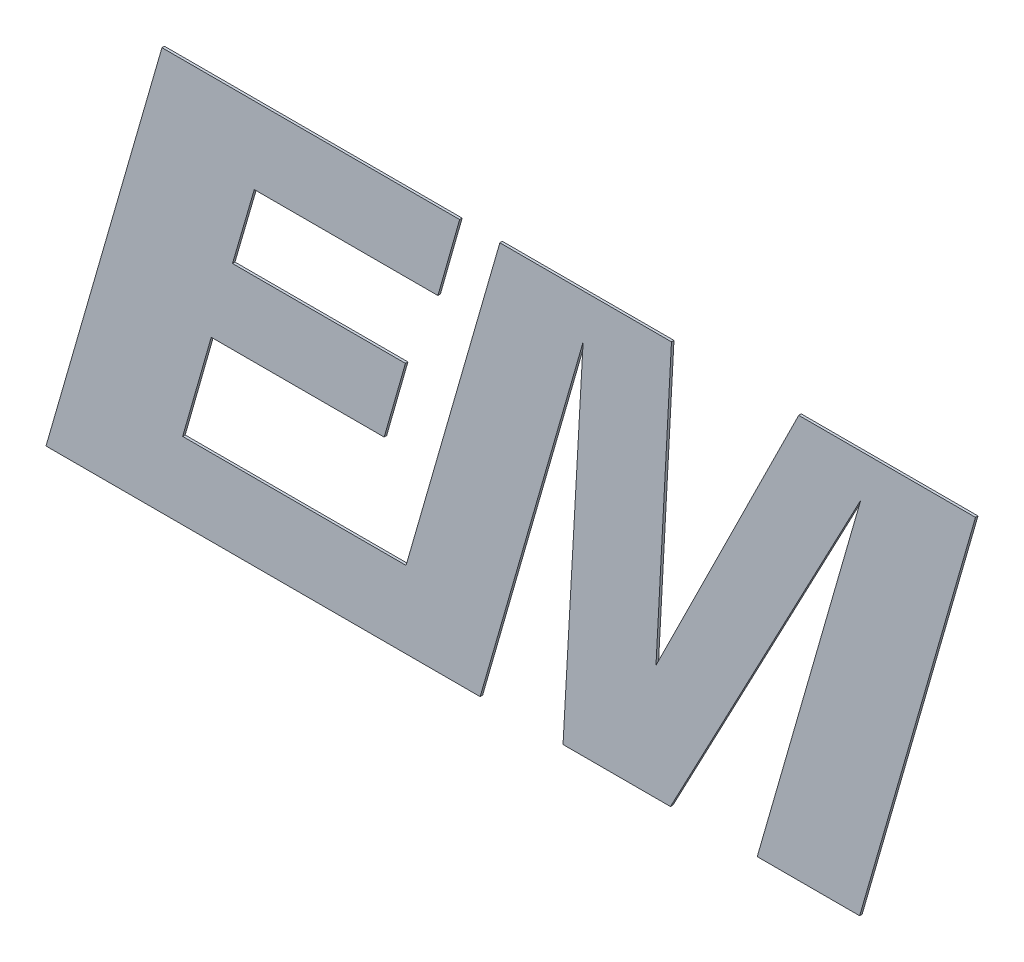
ISO-10303-21;
HEADER;
FILE_DESCRIPTION(('STEP AP214'),'2;1');
FILE_NAME('part.step','',(''),(''),'','','');
FILE_SCHEMA(('AUTOMOTIVE_DESIGN { 1 0 10303 214 1 1 1 1 }'));
ENDSEC;
DATA;
#1=APPLICATION_CONTEXT('core data for automotive mechanical design processes');
#2=APPLICATION_PROTOCOL_DEFINITION('international standard','automotive_design',2000,#1);
#3=PRODUCT_CONTEXT('',#1,'mechanical');
#4=PRODUCT('Part','Part','',(#3));
#5=PRODUCT_RELATED_PRODUCT_CATEGORY('part','',(#4));
#6=PRODUCT_DEFINITION_FORMATION('','',#4);
#7=PRODUCT_DEFINITION_CONTEXT('part definition',#1,'design');
#8=PRODUCT_DEFINITION('design','',#6,#7);
#9=PRODUCT_DEFINITION_SHAPE('','',#8);
#10=(LENGTH_UNIT() NAMED_UNIT(*) SI_UNIT(.MILLI.,.METRE.));
#11=(NAMED_UNIT(*) PLANE_ANGLE_UNIT() SI_UNIT($,.RADIAN.));
#12=(NAMED_UNIT(*) SI_UNIT($,.STERADIAN.) SOLID_ANGLE_UNIT());
#13=UNCERTAINTY_MEASURE_WITH_UNIT(LENGTH_MEASURE(1.E-05),#10,'distance_accuracy_value','');
#14=(GEOMETRIC_REPRESENTATION_CONTEXT(3) GLOBAL_UNCERTAINTY_ASSIGNED_CONTEXT((#13)) GLOBAL_UNIT_ASSIGNED_CONTEXT((#10,
#11,#12)) REPRESENTATION_CONTEXT('',''));
#15=CARTESIAN_POINT('',(0.,0.,0.));
#16=DIRECTION('',(0.,0.,1.));
#17=DIRECTION('',(1.,0.,0.));
#18=AXIS2_PLACEMENT_3D('',#15,#16,#17);
#19=CARTESIAN_POINT('',(4.26764666355344,3.60341048700408,2.505));
#20=DIRECTION('',(0.,-1.,0.));
#21=DIRECTION('',(0.,0.,-1.));
#22=AXIS2_PLACEMENT_3D('',#19,#20,#21);
#23=PLANE('',#22);
#24=DIRECTION('',(-1.,0.,0.));
#25=VECTOR('',#24,1.);
#26=CARTESIAN_POINT('',(4.26764666355344,3.60341048700408,2.5));
#27=LINE('',#26,#25);
#28=CARTESIAN_POINT('',(4.26764666355344,3.60341048700408,2.5));
#29=VERTEX_POINT('',#28);
#30=CARTESIAN_POINT('',(3.91393857891431,3.60341048700408,2.5));
#31=VERTEX_POINT('',#30);
#32=EDGE_CURVE('E11',#29,#31,#27,.T.);
#33=ORIENTED_EDGE('',*,*,#32,.T.);
#34=DIRECTION('',(0.,0.,-1.));
#35=VECTOR('',#34,1.);
#36=CARTESIAN_POINT('',(3.91393857891431,3.60341048700408,2.505));
#37=LINE('',#36,#35);
#38=CARTESIAN_POINT('',(3.91393857891431,3.60341048700408,2.505));
#39=VERTEX_POINT('',#38);
#40=EDGE_CURVE('E41',#39,#31,#37,.T.);
#41=ORIENTED_EDGE('',*,*,#40,.F.);
#42=DIRECTION('',(-1.,0.,0.));
#43=VECTOR('',#42,1.);
#44=CARTESIAN_POINT('',(4.26764666355344,3.60341048700408,2.505));
#45=LINE('',#44,#43);
#46=CARTESIAN_POINT('',(4.26764666355344,3.60341048700408,2.505));
#47=VERTEX_POINT('',#46);
#48=EDGE_CURVE('E54',#47,#39,#45,.T.);
#49=ORIENTED_EDGE('',*,*,#48,.F.);
#50=DIRECTION('',(0.,0.,-1.));
#51=VECTOR('',#50,1.);
#52=CARTESIAN_POINT('',(4.26764666355344,3.60341048700408,2.505));
#53=LINE('',#52,#51);
#54=EDGE_CURVE('E27',#47,#29,#53,.T.);
#55=ORIENTED_EDGE('',*,*,#54,.T.);
#56=EDGE_LOOP('',(#33,#41,#49,#55));
#57=FACE_BOUND('',#56,.T.);
#58=ADVANCED_FACE('F17',(#57),#23,.F.);
#59=CARTESIAN_POINT('',(3.91393857891431,3.60341048700408,2.505));
#60=DIRECTION('',(0.89586763618268,-0.444321030832952,0.));
#61=DIRECTION('',(0.,0.,-1.));
#62=AXIS2_PLACEMENT_3D('',#59,#60,#61);
#63=PLANE('',#62);
#64=DIRECTION('',(-0.444321030832952,-0.89586763618268,0.));
#65=VECTOR('',#64,1.);
#66=CARTESIAN_POINT('',(3.91393857891431,3.60341048700408,2.5));
#67=LINE('',#66,#65);
#68=CARTESIAN_POINT('',(3.62818914903049,3.02726475334241,2.5));
#69=VERTEX_POINT('',#68);
#70=EDGE_CURVE('E238',#31,#69,#67,.T.);
#71=ORIENTED_EDGE('',*,*,#70,.T.);
#72=DIRECTION('',(0.,0.,-1.));
#73=VECTOR('',#72,1.);
#74=CARTESIAN_POINT('',(3.62818914903049,3.02726475334241,2.505));
#75=LINE('',#74,#73);
#76=CARTESIAN_POINT('',(3.62818914903049,3.02726475334241,2.505));
#77=VERTEX_POINT('',#76);
#78=EDGE_CURVE('E331',#77,#69,#75,.T.);
#79=ORIENTED_EDGE('',*,*,#78,.F.);
#80=DIRECTION('',(-0.444321030832952,-0.89586763618268,0.));
#81=VECTOR('',#80,1.);
#82=CARTESIAN_POINT('',(3.91393857891431,3.60341048700408,2.505));
#83=LINE('',#82,#81);
#84=EDGE_CURVE('E288',#39,#77,#83,.T.);
#85=ORIENTED_EDGE('',*,*,#84,.F.);
#86=ORIENTED_EDGE('',*,*,#40,.T.);
#87=EDGE_LOOP('',(#71,#79,#85,#86));
#88=FACE_BOUND('',#87,.T.);
#89=ADVANCED_FACE('F544',(#88),#63,.F.);
#90=CARTESIAN_POINT('',(3.62818914903049,3.02726475334241,2.505));
#91=DIRECTION('',(-0.998554284376095,0.0537525920690858,0.));
#92=DIRECTION('',(0.,0.,1.));
#93=AXIS2_PLACEMENT_3D('',#90,#91,#92);
#94=PLANE('',#93);
#95=DIRECTION('',(0.0537525920690858,0.998554284376095,0.));
#96=VECTOR('',#95,1.);
#97=CARTESIAN_POINT('',(3.62818914903049,3.02726475334241,2.5));
#98=LINE('',#97,#96);
#99=CARTESIAN_POINT('',(3.65920331328618,3.60341048700408,2.5));
#100=VERTEX_POINT('',#99);
#101=EDGE_CURVE('E345',#69,#100,#98,.T.);
#102=ORIENTED_EDGE('',*,*,#101,.T.);
#103=DIRECTION('',(0.,0.,-1.));
#104=VECTOR('',#103,1.);
#105=CARTESIAN_POINT('',(3.65920331328618,3.60341048700408,2.505));
#106=LINE('',#105,#104);
#107=CARTESIAN_POINT('',(3.65920331328618,3.60341048700408,2.505));
#108=VERTEX_POINT('',#107);
#109=EDGE_CURVE('E273',#108,#100,#106,.T.);
#110=ORIENTED_EDGE('',*,*,#109,.F.);
#111=DIRECTION('',(0.0537525920690858,0.998554284376095,0.));
#112=VECTOR('',#111,1.);
#113=CARTESIAN_POINT('',(3.62818914903049,3.02726475334241,2.505));
#114=LINE('',#113,#112);
#115=EDGE_CURVE('E249',#77,#108,#114,.T.);
#116=ORIENTED_EDGE('',*,*,#115,.F.);
#117=ORIENTED_EDGE('',*,*,#78,.T.);
#118=EDGE_LOOP('',(#102,#110,#116,#117));
#119=FACE_BOUND('',#118,.T.);
#120=ADVANCED_FACE('F539',(#119),#94,.F.);
#121=CARTESIAN_POINT('',(3.65920331328618,3.60341048700408,2.505));
#122=DIRECTION('',(0.,-1.,0.));
#123=DIRECTION('',(0.,0.,-1.));
#124=AXIS2_PLACEMENT_3D('',#121,#122,#123);
#125=PLANE('',#124);
#126=DIRECTION('',(-1.,0.,0.));
#127=VECTOR('',#126,1.);
#128=CARTESIAN_POINT('',(3.65920331328618,3.60341048700408,2.5));
#129=LINE('',#128,#127);
#130=CARTESIAN_POINT('',(3.3157603234188,3.60341048700408,2.5));
#131=VERTEX_POINT('',#130);
#132=EDGE_CURVE('E276',#100,#131,#129,.T.);
#133=ORIENTED_EDGE('',*,*,#132,.T.);
#134=DIRECTION('',(0.,0.,-1.));
#135=VECTOR('',#134,1.);
#136=CARTESIAN_POINT('',(3.3157603234188,3.60341048700408,2.505));
#137=LINE('',#136,#135);
#138=CARTESIAN_POINT('',(3.3157603234188,3.60341048700408,2.505));
#139=VERTEX_POINT('',#138);
#140=EDGE_CURVE('E282',#139,#131,#137,.T.);
#141=ORIENTED_EDGE('',*,*,#140,.F.);
#142=DIRECTION('',(-1.,0.,0.));
#143=VECTOR('',#142,1.);
#144=CARTESIAN_POINT('',(3.65920331328618,3.60341048700408,2.505));
#145=LINE('',#144,#143);
#146=EDGE_CURVE('E241',#108,#139,#145,.T.);
#147=ORIENTED_EDGE('',*,*,#146,.F.);
#148=ORIENTED_EDGE('',*,*,#109,.T.);
#149=EDGE_LOOP('',(#133,#141,#147,#148));
#150=FACE_BOUND('',#149,.T.);
#151=ADVANCED_FACE('F543',(#150),#125,.F.);
#152=CARTESIAN_POINT('',(3.3157603234188,3.60341048700408,2.505));
#153=DIRECTION('',(0.961085306551383,-0.276251757516641,0.));
#154=DIRECTION('',(0.,0.,-1.));
#155=AXIS2_PLACEMENT_3D('',#152,#153,#154);
#156=PLANE('',#155);
#157=DIRECTION('',(-0.276251757516641,-0.961085306551383,0.));
#158=VECTOR('',#157,1.);
#159=CARTESIAN_POINT('',(3.3157603234188,3.60341048700408,2.5));
#160=LINE('',#159,#158);
#161=CARTESIAN_POINT('',(3.12805489301933,2.95037959685322,2.5));
#162=VERTEX_POINT('',#161);
#163=EDGE_CURVE('E277',#131,#162,#160,.T.);
#164=ORIENTED_EDGE('',*,*,#163,.T.);
#165=DIRECTION('',(0.,0.,-1.));
#166=VECTOR('',#165,1.);
#167=CARTESIAN_POINT('',(3.12805489301933,2.95037959685322,2.505));
#168=LINE('',#167,#166);
#169=CARTESIAN_POINT('',(3.12805489301933,2.95037959685322,2.505));
#170=VERTEX_POINT('',#169);
#171=EDGE_CURVE('E283',#170,#162,#168,.T.);
#172=ORIENTED_EDGE('',*,*,#171,.F.);
#173=DIRECTION('',(-0.276251757516641,-0.961085306551383,0.));
#174=VECTOR('',#173,1.);
#175=CARTESIAN_POINT('',(3.3157603234188,3.60341048700408,2.505));
#176=LINE('',#175,#174);
#177=EDGE_CURVE('E239',#139,#170,#176,.T.);
#178=ORIENTED_EDGE('',*,*,#177,.F.);
#179=ORIENTED_EDGE('',*,*,#140,.T.);
#180=EDGE_LOOP('',(#164,#172,#178,#179));
#181=FACE_BOUND('',#180,.T.);
#182=ADVANCED_FACE('F586',(#181),#156,.F.);
#183=CARTESIAN_POINT('',(3.12805489301933,2.95037959685322,2.505));
#184=DIRECTION('',(0.,-1.,0.));
#185=DIRECTION('',(0.,0.,-1.));
#186=AXIS2_PLACEMENT_3D('',#183,#184,#185);
#187=PLANE('',#186);
#188=DIRECTION('',(-1.,0.,0.));
#189=VECTOR('',#188,1.);
#190=CARTESIAN_POINT('',(3.12805489301933,2.95037959685322,2.5));
#191=LINE('',#190,#189);
#192=CARTESIAN_POINT('',(2.68099778065785,2.95037959685322,2.5));
#193=VERTEX_POINT('',#192);
#194=EDGE_CURVE('E278',#162,#193,#191,.T.);
#195=ORIENTED_EDGE('',*,*,#194,.T.);
#196=DIRECTION('',(0.,0.,-1.));
#197=VECTOR('',#196,1.);
#198=CARTESIAN_POINT('',(2.68099778065785,2.95037959685322,2.505));
#199=LINE('',#198,#197);
#200=CARTESIAN_POINT('',(2.68099778065785,2.95037959685322,2.505));
#201=VERTEX_POINT('',#200);
#202=EDGE_CURVE('E362',#201,#193,#199,.T.);
#203=ORIENTED_EDGE('',*,*,#202,.F.);
#204=DIRECTION('',(-1.,0.,0.));
#205=VECTOR('',#204,1.);
#206=CARTESIAN_POINT('',(3.12805489301933,2.95037959685322,2.505));
#207=LINE('',#206,#205);
#208=EDGE_CURVE('E242',#170,#201,#207,.T.);
#209=ORIENTED_EDGE('',*,*,#208,.F.);
#210=ORIENTED_EDGE('',*,*,#171,.T.);
#211=EDGE_LOOP('',(#195,#203,#209,#210));
#212=FACE_BOUND('',#211,.T.);
#213=ADVANCED_FACE('F570',(#212),#187,.F.);
#214=CARTESIAN_POINT('',(2.68099778065785,2.95037959685322,2.505));
#215=DIRECTION('',(-0.96172348726206,0.274021776595406,0.));
#216=DIRECTION('',(0.,0.,1.));
#217=AXIS2_PLACEMENT_3D('',#214,#215,#216);
#218=PLANE('',#217);
#219=DIRECTION('',(0.274021776595406,0.96172348726206,0.));
#220=VECTOR('',#219,1.);
#221=CARTESIAN_POINT('',(2.68099778065785,2.95037959685322,2.5));
#222=LINE('',#221,#220);
#223=CARTESIAN_POINT('',(2.73810782238338,3.15081647150003,2.5));
#224=VERTEX_POINT('',#223);
#225=EDGE_CURVE('E370',#193,#224,#222,.T.);
#226=ORIENTED_EDGE('',*,*,#225,.T.);
#227=DIRECTION('',(0.,0.,-1.));
#228=VECTOR('',#227,1.);
#229=CARTESIAN_POINT('',(2.73810782238338,3.15081647150003,2.505));
#230=LINE('',#229,#228);
#231=CARTESIAN_POINT('',(2.73810782238338,3.15081647150003,2.505));
#232=VERTEX_POINT('',#231);
#233=EDGE_CURVE('E266',#232,#224,#230,.T.);
#234=ORIENTED_EDGE('',*,*,#233,.F.);
#235=DIRECTION('',(0.274021776595406,0.96172348726206,0.));
#236=VECTOR('',#235,1.);
#237=CARTESIAN_POINT('',(2.68099778065785,2.95037959685322,2.505));
#238=LINE('',#237,#236);
#239=EDGE_CURVE('E252',#201,#232,#238,.T.);
#240=ORIENTED_EDGE('',*,*,#239,.F.);
#241=ORIENTED_EDGE('',*,*,#202,.T.);
#242=EDGE_LOOP('',(#226,#234,#240,#241));
#243=FACE_BOUND('',#242,.T.);
#244=ADVANCED_FACE('F565',(#243),#218,.F.);
#245=CARTESIAN_POINT('',(2.73810782238338,3.15081647150003,2.505));
#246=DIRECTION('',(0.,1.,0.));
#247=DIRECTION('',(1.,0.,0.));
#248=AXIS2_PLACEMENT_3D('',#245,#246,#247);
#249=PLANE('',#248);
#250=DIRECTION('',(1.,0.,0.));
#251=VECTOR('',#250,1.);
#252=CARTESIAN_POINT('',(2.73810782238338,3.15081647150003,2.5));
#253=LINE('',#252,#251);
#254=CARTESIAN_POINT('',(3.08420105076243,3.15081647150003,2.5));
#255=VERTEX_POINT('',#254);
#256=EDGE_CURVE('E358',#224,#255,#253,.T.);
#257=ORIENTED_EDGE('',*,*,#256,.T.);
#258=DIRECTION('',(0.,0.,-1.));
#259=VECTOR('',#258,1.);
#260=CARTESIAN_POINT('',(3.08420105076243,3.15081647150003,2.505));
#261=LINE('',#260,#259);
#262=CARTESIAN_POINT('',(3.08420105076243,3.15081647150003,2.505));
#263=VERTEX_POINT('',#262);
#264=EDGE_CURVE('E309',#263,#255,#261,.T.);
#265=ORIENTED_EDGE('',*,*,#264,.F.);
#266=DIRECTION('',(1.,0.,0.));
#267=VECTOR('',#266,1.);
#268=CARTESIAN_POINT('',(2.73810782238338,3.15081647150003,2.505));
#269=LINE('',#268,#267);
#270=EDGE_CURVE('E262',#232,#263,#269,.T.);
#271=ORIENTED_EDGE('',*,*,#270,.F.);
#272=ORIENTED_EDGE('',*,*,#233,.T.);
#273=EDGE_LOOP('',(#257,#265,#271,#272));
#274=FACE_BOUND('',#273,.T.);
#275=ADVANCED_FACE('F569',(#274),#249,.F.);
#276=CARTESIAN_POINT('',(3.08420105076243,3.15081647150003,2.505));
#277=DIRECTION('',(-0.961545429433448,0.27464593049169,0.));
#278=DIRECTION('',(0.,0.,1.));
#279=AXIS2_PLACEMENT_3D('',#276,#277,#278);
#280=PLANE('',#279);
#281=DIRECTION('',(0.27464593049169,0.961545429433448,0.));
#282=VECTOR('',#281,1.);
#283=CARTESIAN_POINT('',(3.08420105076243,3.15081647150003,2.5));
#284=LINE('',#283,#282);
#285=CARTESIAN_POINT('',(3.12678469114908,3.2999033511385,2.5));
#286=VERTEX_POINT('',#285);
#287=EDGE_CURVE('E414',#255,#286,#284,.T.);
#288=ORIENTED_EDGE('',*,*,#287,.T.);
#289=DIRECTION('',(0.,0.,-1.));
#290=VECTOR('',#289,1.);
#291=CARTESIAN_POINT('',(3.12678469114908,3.2999033511385,2.505));
#292=LINE('',#291,#290);
#293=CARTESIAN_POINT('',(3.12678469114908,3.2999033511385,2.505));
#294=VERTEX_POINT('',#293);
#295=EDGE_CURVE('E310',#294,#286,#292,.T.);
#296=ORIENTED_EDGE('',*,*,#295,.F.);
#297=DIRECTION('',(0.27464593049169,0.961545429433448,0.));
#298=VECTOR('',#297,1.);
#299=CARTESIAN_POINT('',(3.08420105076243,3.15081647150003,2.505));
#300=LINE('',#299,#298);
#301=EDGE_CURVE('E314',#263,#294,#300,.T.);
#302=ORIENTED_EDGE('',*,*,#301,.F.);
#303=ORIENTED_EDGE('',*,*,#264,.T.);
#304=EDGE_LOOP('',(#288,#296,#302,#303));
#305=FACE_BOUND('',#304,.T.);
#306=ADVANCED_FACE('F620',(#305),#280,.F.);
#307=CARTESIAN_POINT('',(3.12678469114908,3.2999033511385,2.505));
#308=DIRECTION('',(0.,-1.,0.));
#309=DIRECTION('',(0.,0.,-1.));
#310=AXIS2_PLACEMENT_3D('',#307,#308,#309);
#311=PLANE('',#310);
#312=DIRECTION('',(-1.,0.,0.));
#313=VECTOR('',#312,1.);
#314=CARTESIAN_POINT('',(3.12678469114908,3.2999033511385,2.5));
#315=LINE('',#314,#313);
#316=CARTESIAN_POINT('',(2.78064242022671,3.2999033511385,2.5));
#317=VERTEX_POINT('',#316);
#318=EDGE_CURVE('E305',#286,#317,#315,.T.);
#319=ORIENTED_EDGE('',*,*,#318,.T.);
#320=DIRECTION('',(0.,0.,-1.));
#321=VECTOR('',#320,1.);
#322=CARTESIAN_POINT('',(2.78064242022671,3.2999033511385,2.505));
#323=LINE('',#322,#321);
#324=CARTESIAN_POINT('',(2.78064242022671,3.2999033511385,2.505));
#325=VERTEX_POINT('',#324);
#326=EDGE_CURVE('E271',#325,#317,#323,.T.);
#327=ORIENTED_EDGE('',*,*,#326,.F.);
#328=DIRECTION('',(-1.,0.,0.));
#329=VECTOR('',#328,1.);
#330=CARTESIAN_POINT('',(3.12678469114908,3.2999033511385,2.505));
#331=LINE('',#330,#329);
#332=EDGE_CURVE('E311',#294,#325,#331,.T.);
#333=ORIENTED_EDGE('',*,*,#332,.F.);
#334=ORIENTED_EDGE('',*,*,#295,.T.);
#335=EDGE_LOOP('',(#319,#327,#333,#334));
#336=FACE_BOUND('',#335,.T.);
#337=ADVANCED_FACE('F596',(#336),#311,.F.);
#338=CARTESIAN_POINT('',(2.78064242022671,3.2999033511385,2.505));
#339=DIRECTION('',(-0.960176311432759,0.27939479408783,0.));
#340=DIRECTION('',(0.,0.,1.));
#341=AXIS2_PLACEMENT_3D('',#338,#339,#340);
#342=PLANE('',#341);
#343=DIRECTION('',(0.27939479408783,0.960176311432759,0.));
#344=VECTOR('',#343,1.);
#345=CARTESIAN_POINT('',(2.78064242022671,3.2999033511385,2.5));
#346=LINE('',#345,#344);
#347=CARTESIAN_POINT('',(2.8242902838039,3.44990487421018,2.5));
#348=VERTEX_POINT('',#347);
#349=EDGE_CURVE('E316',#317,#348,#346,.T.);
#350=ORIENTED_EDGE('',*,*,#349,.T.);
#351=DIRECTION('',(0.,0.,-1.));
#352=VECTOR('',#351,1.);
#353=CARTESIAN_POINT('',(2.8242902838039,3.44990487421018,2.505));
#354=LINE('',#353,#352);
#355=CARTESIAN_POINT('',(2.8242902838039,3.44990487421018,2.505));
#356=VERTEX_POINT('',#355);
#357=EDGE_CURVE('E272',#356,#348,#354,.T.);
#358=ORIENTED_EDGE('',*,*,#357,.F.);
#359=DIRECTION('',(0.27939479408783,0.960176311432759,0.));
#360=VECTOR('',#359,1.);
#361=CARTESIAN_POINT('',(2.78064242022671,3.2999033511385,2.505));
#362=LINE('',#361,#360);
#363=EDGE_CURVE('E315',#325,#356,#362,.T.);
#364=ORIENTED_EDGE('',*,*,#363,.F.);
#365=ORIENTED_EDGE('',*,*,#326,.T.);
#366=EDGE_LOOP('',(#350,#358,#364,#365));
#367=FACE_BOUND('',#366,.T.);
#368=ADVANCED_FACE('F592',(#367),#342,.F.);
#369=CARTESIAN_POINT('',(2.8242902838039,3.44990487421018,2.505));
#370=DIRECTION('',(0.,1.,0.));
#371=DIRECTION('',(1.,0.,0.));
#372=AXIS2_PLACEMENT_3D('',#369,#370,#371);
#373=PLANE('',#372);
#374=DIRECTION('',(1.,0.,0.));
#375=VECTOR('',#374,1.);
#376=CARTESIAN_POINT('',(2.8242902838039,3.44990487421018,2.5));
#377=LINE('',#376,#375);
#378=CARTESIAN_POINT('',(3.19172192279194,3.44990487421018,2.5));
#379=VERTEX_POINT('',#378);
#380=EDGE_CURVE('E268',#348,#379,#377,.T.);
#381=ORIENTED_EDGE('',*,*,#380,.T.);
#382=DIRECTION('',(0.,0.,-1.));
#383=VECTOR('',#382,1.);
#384=CARTESIAN_POINT('',(3.19172192279194,3.44990487421018,2.505));
#385=LINE('',#384,#383);
#386=CARTESIAN_POINT('',(3.19172192279194,3.44990487421018,2.505));
#387=VERTEX_POINT('',#386);
#388=EDGE_CURVE('E335',#387,#379,#385,.T.);
#389=ORIENTED_EDGE('',*,*,#388,.F.);
#390=DIRECTION('',(1.,0.,0.));
#391=VECTOR('',#390,1.);
#392=CARTESIAN_POINT('',(2.8242902838039,3.44990487421018,2.505));
#393=LINE('',#392,#391);
#394=EDGE_CURVE('E322',#356,#387,#393,.T.);
#395=ORIENTED_EDGE('',*,*,#394,.F.);
#396=ORIENTED_EDGE('',*,*,#357,.T.);
#397=EDGE_LOOP('',(#381,#389,#395,#396));
#398=FACE_BOUND('',#397,.T.);
#399=ADVANCED_FACE('F501',(#398),#373,.F.);
#400=CARTESIAN_POINT('',(3.19172192279194,3.44990487421018,2.505));
#401=DIRECTION('',(-0.961953028041548,0.273214882174628,0.));
#402=DIRECTION('',(0.,0.,1.));
#403=AXIS2_PLACEMENT_3D('',#400,#401,#402);
#404=PLANE('',#403);
#405=DIRECTION('',(0.273214882174628,0.961953028041548,0.));
#406=VECTOR('',#405,1.);
#407=CARTESIAN_POINT('',(3.19172192279194,3.44990487421018,2.5));
#408=LINE('',#407,#406);
#409=CARTESIAN_POINT('',(3.23532074382587,3.60341048700408,2.5));
#410=VERTEX_POINT('',#409);
#411=EDGE_CURVE('E296',#379,#410,#408,.T.);
#412=ORIENTED_EDGE('',*,*,#411,.T.);
#413=DIRECTION('',(0.,0.,-1.));
#414=VECTOR('',#413,1.);
#415=CARTESIAN_POINT('',(3.23532074382587,3.60341048700408,2.505));
#416=LINE('',#415,#414);
#417=CARTESIAN_POINT('',(3.23532074382587,3.60341048700408,2.505));
#418=VERTEX_POINT('',#417);
#419=EDGE_CURVE('E349',#418,#410,#416,.T.);
#420=ORIENTED_EDGE('',*,*,#419,.F.);
#421=DIRECTION('',(0.273214882174628,0.961953028041548,0.));
#422=VECTOR('',#421,1.);
#423=CARTESIAN_POINT('',(3.19172192279194,3.44990487421018,2.505));
#424=LINE('',#423,#422);
#425=EDGE_CURVE('E369',#387,#418,#424,.T.);
#426=ORIENTED_EDGE('',*,*,#425,.F.);
#427=ORIENTED_EDGE('',*,*,#388,.T.);
#428=EDGE_LOOP('',(#412,#420,#426,#427));
#429=FACE_BOUND('',#428,.T.);
#430=ADVANCED_FACE('F503',(#429),#404,.F.);
#431=CARTESIAN_POINT('',(3.23532074382587,3.60341048700408,2.505));
#432=DIRECTION('',(0.,-1.,0.));
#433=DIRECTION('',(0.,0.,-1.));
#434=AXIS2_PLACEMENT_3D('',#431,#432,#433);
#435=PLANE('',#434);
#436=DIRECTION('',(-1.,0.,0.));
#437=VECTOR('',#436,1.);
#438=CARTESIAN_POINT('',(3.23532074382587,3.60341048700408,2.5));
#439=LINE('',#438,#437);
#440=CARTESIAN_POINT('',(2.63953476239201,3.60341048700408,2.5));
#441=VERTEX_POINT('',#440);
#442=EDGE_CURVE('E375',#410,#441,#439,.T.);
#443=ORIENTED_EDGE('',*,*,#442,.T.);
#444=DIRECTION('',(0.,0.,-1.));
#445=VECTOR('',#444,1.);
#446=CARTESIAN_POINT('',(2.63953476239201,3.60341048700408,2.505));
#447=LINE('',#446,#445);
#448=CARTESIAN_POINT('',(2.63953476239201,3.60341048700408,2.505));
#449=VERTEX_POINT('',#448);
#450=EDGE_CURVE('E336',#449,#441,#447,.T.);
#451=ORIENTED_EDGE('',*,*,#450,.F.);
#452=DIRECTION('',(-1.,0.,0.));
#453=VECTOR('',#452,1.);
#454=CARTESIAN_POINT('',(3.23532074382587,3.60341048700408,2.505));
#455=LINE('',#454,#453);
#456=EDGE_CURVE('E365',#418,#449,#455,.T.);
#457=ORIENTED_EDGE('',*,*,#456,.F.);
#458=ORIENTED_EDGE('',*,*,#419,.T.);
#459=EDGE_LOOP('',(#443,#451,#457,#458));
#460=FACE_BOUND('',#459,.T.);
#461=ADVANCED_FACE('F506',(#460),#435,.F.);
#462=CARTESIAN_POINT('',(2.63953476239201,3.60341048700408,2.505));
#463=DIRECTION('',(0.961002990822128,-0.276537975024996,0.));
#464=DIRECTION('',(0.,0.,-1.));
#465=AXIS2_PLACEMENT_3D('',#462,#463,#464);
#466=PLANE('',#465);
#467=DIRECTION('',(-0.276537975024996,-0.961002990822128,0.));
#468=VECTOR('',#467,1.);
#469=CARTESIAN_POINT('',(2.63953476239201,3.60341048700408,2.5));
#470=LINE('',#469,#468);
#471=CARTESIAN_POINT('',(2.40746789876758,2.79695,2.5));
#472=VERTEX_POINT('',#471);
#473=EDGE_CURVE('E339',#441,#472,#470,.T.);
#474=ORIENTED_EDGE('',*,*,#473,.T.);
#475=DIRECTION('',(0.,0.,-1.));
#476=VECTOR('',#475,1.);
#477=CARTESIAN_POINT('',(2.40746789876758,2.79695,2.505));
#478=LINE('',#477,#476);
#479=CARTESIAN_POINT('',(2.40746789876758,2.79695,2.505));
#480=VERTEX_POINT('',#479);
#481=EDGE_CURVE('E354',#480,#472,#478,.T.);
#482=ORIENTED_EDGE('',*,*,#481,.F.);
#483=DIRECTION('',(-0.276537975024996,-0.961002990822128,0.));
#484=VECTOR('',#483,1.);
#485=CARTESIAN_POINT('',(2.63953476239201,3.60341048700408,2.505));
#486=LINE('',#485,#484);
#487=EDGE_CURVE('E300',#449,#480,#486,.T.);
#488=ORIENTED_EDGE('',*,*,#487,.F.);
#489=ORIENTED_EDGE('',*,*,#450,.T.);
#490=EDGE_LOOP('',(#474,#482,#488,#489));
#491=FACE_BOUND('',#490,.T.);
#492=ADVANCED_FACE('F471',(#491),#466,.F.);
#493=CARTESIAN_POINT('',(3.13272619462976,2.79695,2.505));
#494=DIRECTION('',(0.,1.,0.));
#495=DIRECTION('',(1.,0.,0.));
#496=AXIS2_PLACEMENT_3D('',#493,#494,#495);
#497=PLANE('',#496);
#498=DIRECTION('',(1.,0.,0.));
#499=VECTOR('',#498,1.);
#500=CARTESIAN_POINT('',(3.13272619462976,2.79695,2.5));
#501=LINE('',#500,#499);
#502=CARTESIAN_POINT('',(3.27627371899784,2.79695,2.5));
#503=VERTEX_POINT('',#502);
#504=EDGE_CURVE('E21',#472,#503,#501,.T.);
#505=ORIENTED_EDGE('',*,*,#504,.T.);
#506=DIRECTION('',(0.,0.,-1.));
#507=VECTOR('',#506,1.);
#508=CARTESIAN_POINT('',(3.27627371899784,2.79695,2.505));
#509=LINE('',#508,#507);
#510=CARTESIAN_POINT('',(3.27627371899784,2.79695,2.505));
#511=VERTEX_POINT('',#510);
#512=EDGE_CURVE('E355',#511,#503,#509,.T.);
#513=ORIENTED_EDGE('',*,*,#512,.F.);
#514=DIRECTION('',(1.,0.,0.));
#515=VECTOR('',#514,1.);
#516=CARTESIAN_POINT('',(2.40746789876758,2.79695,2.505));
#517=LINE('',#516,#515);
#518=EDGE_CURVE('E297',#480,#511,#517,.T.);
#519=ORIENTED_EDGE('',*,*,#518,.F.);
#520=ORIENTED_EDGE('',*,*,#481,.T.);
#521=EDGE_LOOP('',(#505,#513,#519,#520));
#522=FACE_BOUND('',#521,.T.);
#523=ADVANCED_FACE('F454',(#522),#497,.F.);
#524=CARTESIAN_POINT('',(3.27627371899784,2.79695,2.505));
#525=DIRECTION('',(-0.961163884540897,0.27597823655907,0.));
#526=DIRECTION('',(0.,0.,1.));
#527=AXIS2_PLACEMENT_3D('',#524,#525,#526);
#528=PLANE('',#527);
#529=DIRECTION('',(0.27597823655907,0.961163884540897,0.));
#530=VECTOR('',#529,1.);
#531=CARTESIAN_POINT('',(3.27627371899784,2.79695,2.5));
#532=LINE('',#531,#530);
#533=CARTESIAN_POINT('',(3.48242404994483,3.51492057392236,2.5));
#534=VERTEX_POINT('',#533);
#535=EDGE_CURVE('E350',#503,#534,#532,.T.);
#536=ORIENTED_EDGE('',*,*,#535,.T.);
#537=DIRECTION('',(0.,0.,-1.));
#538=VECTOR('',#537,1.);
#539=CARTESIAN_POINT('',(3.48242404994483,3.51492057392236,2.505));
#540=LINE('',#539,#538);
#541=CARTESIAN_POINT('',(3.48242404994483,3.51492057392236,2.505));
#542=VERTEX_POINT('',#541);
#543=EDGE_CURVE('E431',#542,#534,#540,.T.);
#544=ORIENTED_EDGE('',*,*,#543,.F.);
#545=DIRECTION('',(0.27597823655907,0.961163884540897,0.));
#546=VECTOR('',#545,1.);
#547=CARTESIAN_POINT('',(3.27627371899784,2.79695,2.505));
#548=LINE('',#547,#546);
#549=EDGE_CURVE('E301',#511,#542,#548,.T.);
#550=ORIENTED_EDGE('',*,*,#549,.F.);
#551=ORIENTED_EDGE('',*,*,#512,.T.);
#552=EDGE_LOOP('',(#536,#544,#550,#551));
#553=FACE_BOUND('',#552,.T.);
#554=ADVANCED_FACE('F464',(#553),#528,.F.);
#555=CARTESIAN_POINT('',(3.48242404994483,3.51492057392236,2.505));
#556=DIRECTION('',(0.998432730113024,-0.0559650197806937,0.));
#557=DIRECTION('',(0.,0.,-1.));
#558=AXIS2_PLACEMENT_3D('',#555,#556,#557);
#559=PLANE('',#558);
#560=DIRECTION('',(-0.0559650197806937,-0.998432730113024,0.));
#561=VECTOR('',#560,1.);
#562=CARTESIAN_POINT('',(3.48242404994483,3.51492057392236,2.5));
#563=LINE('',#562,#561);
#564=CARTESIAN_POINT('',(3.44217973887645,2.79695,2.5));
#565=VERTEX_POINT('',#564);
#566=EDGE_CURVE('E408',#534,#565,#563,.T.);
#567=ORIENTED_EDGE('',*,*,#566,.T.);
#568=DIRECTION('',(0.,0.,-1.));
#569=VECTOR('',#568,1.);
#570=CARTESIAN_POINT('',(3.44217973887645,2.79695,2.505));
#571=LINE('',#570,#569);
#572=CARTESIAN_POINT('',(3.44217973887645,2.79695,2.505));
#573=VERTEX_POINT('',#572);
#574=EDGE_CURVE('E323',#573,#565,#571,.T.);
#575=ORIENTED_EDGE('',*,*,#574,.F.);
#576=DIRECTION('',(-0.0559650197806937,-0.998432730113024,0.));
#577=VECTOR('',#576,1.);
#578=CARTESIAN_POINT('',(3.48242404994483,3.51492057392236,2.505));
#579=LINE('',#578,#577);
#580=EDGE_CURVE('E342',#542,#573,#579,.T.);
#581=ORIENTED_EDGE('',*,*,#580,.F.);
#582=ORIENTED_EDGE('',*,*,#543,.T.);
#583=EDGE_LOOP('',(#567,#575,#581,#582));
#584=FACE_BOUND('',#583,.T.);
#585=ADVANCED_FACE('F521',(#584),#559,.F.);
#586=CARTESIAN_POINT('',(3.44217973887645,2.79695,2.505));
#587=DIRECTION('',(0.,1.,0.));
#588=DIRECTION('',(1.,0.,0.));
#589=AXIS2_PLACEMENT_3D('',#586,#587,#588);
#590=PLANE('',#589);
#591=DIRECTION('',(1.,0.,0.));
#592=VECTOR('',#591,1.);
#593=CARTESIAN_POINT('',(3.44217973887645,2.79695,2.5));
#594=LINE('',#593,#592);
#595=CARTESIAN_POINT('',(3.65717489251533,2.79695,2.5));
#596=VERTEX_POINT('',#595);
#597=EDGE_CURVE('E236',#565,#596,#594,.T.);
#598=ORIENTED_EDGE('',*,*,#597,.T.);
#599=DIRECTION('',(0.,0.,-1.));
#600=VECTOR('',#599,1.);
#601=CARTESIAN_POINT('',(3.65717489251533,2.79695,2.505));
#602=LINE('',#601,#600);
#603=CARTESIAN_POINT('',(3.65717489251533,2.79695,2.505));
#604=VERTEX_POINT('',#603);
#605=EDGE_CURVE('E286',#604,#596,#602,.T.);
#606=ORIENTED_EDGE('',*,*,#605,.F.);
#607=DIRECTION('',(1.,0.,0.));
#608=VECTOR('',#607,1.);
#609=CARTESIAN_POINT('',(3.44217973887645,2.79695,2.505));
#610=LINE('',#609,#608);
#611=EDGE_CURVE('E292',#573,#604,#610,.T.);
#612=ORIENTED_EDGE('',*,*,#611,.F.);
#613=ORIENTED_EDGE('',*,*,#574,.T.);
#614=EDGE_LOOP('',(#598,#606,#612,#613));
#615=FACE_BOUND('',#614,.T.);
#616=ADVANCED_FACE('F519',(#615),#590,.F.);
#617=CARTESIAN_POINT('',(3.65717489251533,2.79695,2.505));
#618=DIRECTION('',(-0.884338666563768,0.466845930495508,0.));
#619=DIRECTION('',(0.,0.,1.));
#620=AXIS2_PLACEMENT_3D('',#617,#618,#619);
#621=PLANE('',#620);
#622=DIRECTION('',(0.466845930495508,0.884338666563768,0.));
#623=VECTOR('',#622,1.);
#624=CARTESIAN_POINT('',(3.65717489251533,2.79695,2.5));
#625=LINE('',#624,#623);
#626=CARTESIAN_POINT('',(4.03801966710795,3.51837807322648,2.5));
#627=VERTEX_POINT('',#626);
#628=EDGE_CURVE('E327',#596,#627,#625,.T.);
#629=ORIENTED_EDGE('',*,*,#628,.T.);
#630=DIRECTION('',(0.,0.,-1.));
#631=VECTOR('',#630,1.);
#632=CARTESIAN_POINT('',(4.03801966710795,3.51837807322648,2.505));
#633=LINE('',#632,#631);
#634=CARTESIAN_POINT('',(4.03801966710795,3.51837807322648,2.505));
#635=VERTEX_POINT('',#634);
#636=EDGE_CURVE('E287',#635,#627,#633,.T.);
#637=ORIENTED_EDGE('',*,*,#636,.F.);
#638=DIRECTION('',(0.466845930495508,0.884338666563768,0.));
#639=VECTOR('',#638,1.);
#640=CARTESIAN_POINT('',(3.65717489251533,2.79695,2.505));
#641=LINE('',#640,#639);
#642=EDGE_CURVE('E205',#604,#635,#641,.T.);
#643=ORIENTED_EDGE('',*,*,#642,.F.);
#644=ORIENTED_EDGE('',*,*,#605,.T.);
#645=EDGE_LOOP('',(#629,#637,#643,#644));
#646=FACE_BOUND('',#645,.T.);
#647=ADVANCED_FACE('F612',(#646),#621,.F.);
#648=CARTESIAN_POINT('',(4.03801966710795,3.51837807322648,2.505));
#649=DIRECTION('',(0.961154223343868,-0.276011881896858,0.));
#650=DIRECTION('',(0.,0.,-1.));
#651=AXIS2_PLACEMENT_3D('',#648,#649,#650);
#652=PLANE('',#651);
#653=DIRECTION('',(-0.276011881896858,-0.961154223343868,0.));
#654=VECTOR('',#653,1.);
#655=CARTESIAN_POINT('',(4.03801966710795,3.51837807322648,2.5));
#656=LINE('',#655,#654);
#657=CARTESIAN_POINT('',(3.83084925125968,2.79695,2.5));
#658=VERTEX_POINT('',#657);
#659=EDGE_CURVE('E214',#627,#658,#656,.T.);
#660=ORIENTED_EDGE('',*,*,#659,.T.);
#661=DIRECTION('',(0.,0.,-1.));
#662=VECTOR('',#661,1.);
#663=CARTESIAN_POINT('',(3.83084925125968,2.79695,2.505));
#664=LINE('',#663,#662);
#665=CARTESIAN_POINT('',(3.83084925125968,2.79695,2.505));
#666=VERTEX_POINT('',#665);
#667=EDGE_CURVE('E211',#666,#658,#664,.T.);
#668=ORIENTED_EDGE('',*,*,#667,.F.);
#669=DIRECTION('',(-0.276011881896858,-0.961154223343868,0.));
#670=VECTOR('',#669,1.);
#671=CARTESIAN_POINT('',(4.03801966710795,3.51837807322648,2.505));
#672=LINE('',#671,#670);
#673=EDGE_CURVE('E198',#635,#666,#672,.T.);
#674=ORIENTED_EDGE('',*,*,#673,.F.);
#675=ORIENTED_EDGE('',*,*,#636,.T.);
#676=EDGE_LOOP('',(#660,#668,#674,#675));
#677=FACE_BOUND('',#676,.T.);
#678=ADVANCED_FACE('F212',(#677),#652,.F.);
#679=CARTESIAN_POINT('',(3.83084925125968,2.79695,2.505));
#680=DIRECTION('',(0.,1.,0.));
#681=DIRECTION('',(1.,0.,0.));
#682=AXIS2_PLACEMENT_3D('',#679,#680,#681);
#683=PLANE('',#682);
#684=DIRECTION('',(1.,0.,0.));
#685=VECTOR('',#684,1.);
#686=CARTESIAN_POINT('',(3.83084925125968,2.79695,2.5));
#687=LINE('',#686,#685);
#688=CARTESIAN_POINT('',(4.03578332713151,2.79695,2.5));
#689=VERTEX_POINT('',#688);
#690=EDGE_CURVE('E219',#658,#689,#687,.T.);
#691=ORIENTED_EDGE('',*,*,#690,.T.);
#692=DIRECTION('',(0.,0.,-1.));
#693=VECTOR('',#692,1.);
#694=CARTESIAN_POINT('',(4.03578332713151,2.79695,2.505));
#695=LINE('',#694,#693);
#696=CARTESIAN_POINT('',(4.03578332713151,2.79695,2.505));
#697=VERTEX_POINT('',#696);
#698=EDGE_CURVE('E223',#697,#689,#695,.T.);
#699=ORIENTED_EDGE('',*,*,#698,.F.);
#700=DIRECTION('',(1.,0.,0.));
#701=VECTOR('',#700,1.);
#702=CARTESIAN_POINT('',(3.83084925125968,2.79695,2.505));
#703=LINE('',#702,#701);
#704=EDGE_CURVE('E202',#666,#697,#703,.T.);
#705=ORIENTED_EDGE('',*,*,#704,.F.);
#706=ORIENTED_EDGE('',*,*,#667,.T.);
#707=EDGE_LOOP('',(#691,#699,#705,#706));
#708=FACE_BOUND('',#707,.T.);
#709=ADVANCED_FACE('F222',(#708),#683,.F.);
#710=CARTESIAN_POINT('',(4.03578332713151,2.79695,2.505));
#711=DIRECTION('',(-0.961067422110707,0.276313970253912,0.));
#712=DIRECTION('',(0.,0.,1.));
#713=AXIS2_PLACEMENT_3D('',#710,#711,#712);
#714=PLANE('',#713);
#715=DIRECTION('',(0.276313970253912,0.961067422110707,0.));
#716=VECTOR('',#715,1.);
#717=CARTESIAN_POINT('',(4.03578332713151,2.79695,2.5));
#718=LINE('',#717,#716);
#719=EDGE_CURVE('E220',#689,#29,#718,.T.);
#720=ORIENTED_EDGE('',*,*,#719,.T.);
#721=ORIENTED_EDGE('',*,*,#54,.F.);
#722=DIRECTION('',(0.276313970253912,0.961067422110707,0.));
#723=VECTOR('',#722,1.);
#724=CARTESIAN_POINT('',(4.03578332713151,2.79695,2.505));
#725=LINE('',#724,#723);
#726=EDGE_CURVE('E226',#697,#47,#725,.T.);
#727=ORIENTED_EDGE('',*,*,#726,.F.);
#728=ORIENTED_EDGE('',*,*,#698,.T.);
#729=EDGE_LOOP('',(#720,#721,#727,#728));
#730=FACE_BOUND('',#729,.T.);
#731=ADVANCED_FACE('F19',(#730),#714,.F.);
#732=CARTESIAN_POINT('',(-0.0875343276926901,0.18669957358834,2.505));
#733=DIRECTION('',(0.,0.,-1.));
#734=DIRECTION('',(0.,-1.,0.));
#735=AXIS2_PLACEMENT_3D('',#732,#733,#734);
#736=PLANE('',#735);
#737=ORIENTED_EDGE('',*,*,#48,.T.);
#738=ORIENTED_EDGE('',*,*,#84,.T.);
#739=ORIENTED_EDGE('',*,*,#115,.T.);
#740=ORIENTED_EDGE('',*,*,#146,.T.);
#741=ORIENTED_EDGE('',*,*,#177,.T.);
#742=ORIENTED_EDGE('',*,*,#208,.T.);
#743=ORIENTED_EDGE('',*,*,#239,.T.);
#744=ORIENTED_EDGE('',*,*,#270,.T.);
#745=ORIENTED_EDGE('',*,*,#301,.T.);
#746=ORIENTED_EDGE('',*,*,#332,.T.);
#747=ORIENTED_EDGE('',*,*,#363,.T.);
#748=ORIENTED_EDGE('',*,*,#394,.T.);
#749=ORIENTED_EDGE('',*,*,#425,.T.);
#750=ORIENTED_EDGE('',*,*,#456,.T.);
#751=ORIENTED_EDGE('',*,*,#487,.T.);
#752=ORIENTED_EDGE('',*,*,#518,.T.);
#753=ORIENTED_EDGE('',*,*,#549,.T.);
#754=ORIENTED_EDGE('',*,*,#580,.T.);
#755=ORIENTED_EDGE('',*,*,#611,.T.);
#756=ORIENTED_EDGE('',*,*,#642,.T.);
#757=ORIENTED_EDGE('',*,*,#673,.T.);
#758=ORIENTED_EDGE('',*,*,#704,.T.);
#759=ORIENTED_EDGE('',*,*,#726,.T.);
#760=EDGE_LOOP('',(#737,#738,#739,#740,#741,#742,#743,#744,#745,#746,#747,#748,#749,#750,#751,
#752,#753,#754,#755,#756,#757,#758,#759));
#761=FACE_BOUND('',#760,.T.);
#762=ADVANCED_FACE('F200',(#761),#736,.F.);
#763=CARTESIAN_POINT('',(-0.0875343276926901,0.18669957358834,2.5));
#764=DIRECTION('',(0.,0.,-1.));
#765=DIRECTION('',(0.,-1.,0.));
#766=AXIS2_PLACEMENT_3D('',#763,#764,#765);
#767=PLANE('',#766);
#768=ORIENTED_EDGE('',*,*,#32,.F.);
#769=ORIENTED_EDGE('',*,*,#719,.F.);
#770=ORIENTED_EDGE('',*,*,#690,.F.);
#771=ORIENTED_EDGE('',*,*,#659,.F.);
#772=ORIENTED_EDGE('',*,*,#628,.F.);
#773=ORIENTED_EDGE('',*,*,#597,.F.);
#774=ORIENTED_EDGE('',*,*,#566,.F.);
#775=ORIENTED_EDGE('',*,*,#535,.F.);
#776=ORIENTED_EDGE('',*,*,#504,.F.);
#777=ORIENTED_EDGE('',*,*,#473,.F.);
#778=ORIENTED_EDGE('',*,*,#442,.F.);
#779=ORIENTED_EDGE('',*,*,#411,.F.);
#780=ORIENTED_EDGE('',*,*,#380,.F.);
#781=ORIENTED_EDGE('',*,*,#349,.F.);
#782=ORIENTED_EDGE('',*,*,#318,.F.);
#783=ORIENTED_EDGE('',*,*,#287,.F.);
#784=ORIENTED_EDGE('',*,*,#256,.F.);
#785=ORIENTED_EDGE('',*,*,#225,.F.);
#786=ORIENTED_EDGE('',*,*,#194,.F.);
#787=ORIENTED_EDGE('',*,*,#163,.F.);
#788=ORIENTED_EDGE('',*,*,#132,.F.);
#789=ORIENTED_EDGE('',*,*,#101,.F.);
#790=ORIENTED_EDGE('',*,*,#70,.F.);
#791=EDGE_LOOP('',(#768,#769,#770,#771,#772,#773,#774,#775,#776,#777,#778,#779,#780,#781,#782,
#783,#784,#785,#786,#787,#788,#789,#790));
#792=FACE_BOUND('',#791,.T.);
#793=ADVANCED_FACE('F460',(#792),#767,.T.);
#794=CLOSED_SHELL('',(#58,#89,#120,#151,#182,#213,#244,#275,#306,#337,#368,#399,#430,#461,#492,
#523,#554,#585,#616,#647,#678,#709,#731,#762,#793));
#795=MANIFOLD_SOLID_BREP('B1',#794);
#796=ADVANCED_BREP_SHAPE_REPRESENTATION('',(#18,#795),#14);
#797=SHAPE_DEFINITION_REPRESENTATION(#9,#796);
ENDSEC;
END-ISO-10303-21;
